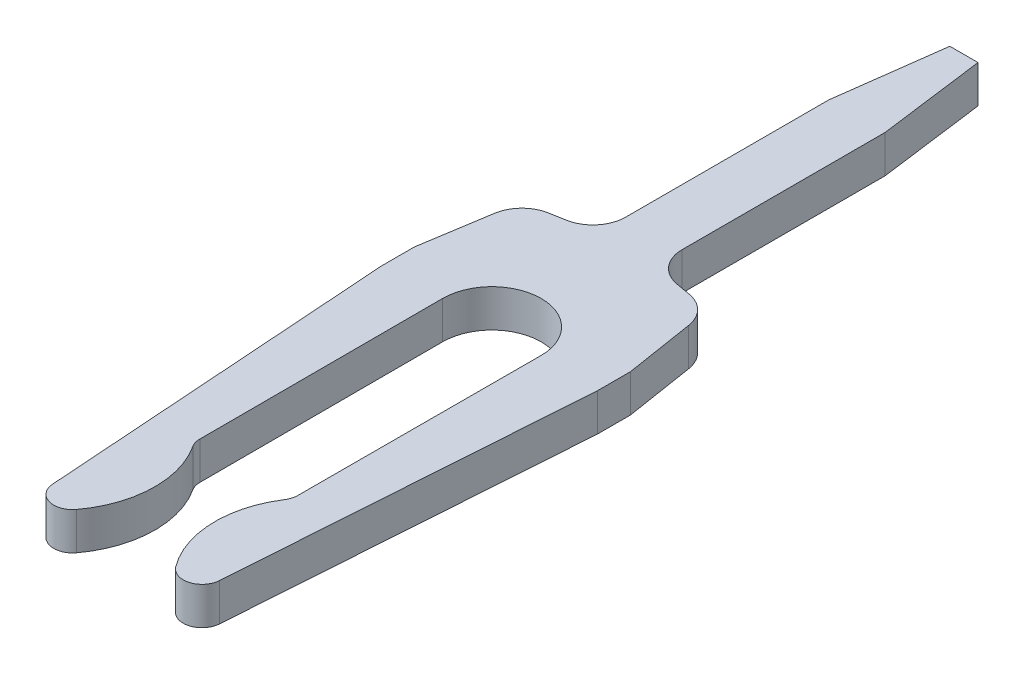
ISO-10303-21;
HEADER;
FILE_DESCRIPTION(('STEP AP214'),'2;1');
FILE_NAME('part.step','',(''),(''),'','','');
FILE_SCHEMA(('AUTOMOTIVE_DESIGN { 1 0 10303 214 1 1 1 1 }'));
ENDSEC;
DATA;
#1=APPLICATION_CONTEXT('core data for automotive mechanical design processes');
#2=APPLICATION_PROTOCOL_DEFINITION('international standard','automotive_design',2000,#1);
#3=PRODUCT_CONTEXT('',#1,'mechanical');
#4=PRODUCT('Part','Part','',(#3));
#5=PRODUCT_RELATED_PRODUCT_CATEGORY('part','',(#4));
#6=PRODUCT_DEFINITION_FORMATION('','',#4);
#7=PRODUCT_DEFINITION_CONTEXT('part definition',#1,'design');
#8=PRODUCT_DEFINITION('design','',#6,#7);
#9=PRODUCT_DEFINITION_SHAPE('','',#8);
#10=(LENGTH_UNIT() NAMED_UNIT(*) SI_UNIT(.MILLI.,.METRE.));
#11=(NAMED_UNIT(*) PLANE_ANGLE_UNIT() SI_UNIT($,.RADIAN.));
#12=(NAMED_UNIT(*) SI_UNIT($,.STERADIAN.) SOLID_ANGLE_UNIT());
#13=UNCERTAINTY_MEASURE_WITH_UNIT(LENGTH_MEASURE(1.E-05),#10,'distance_accuracy_value','');
#14=(GEOMETRIC_REPRESENTATION_CONTEXT(3) GLOBAL_UNCERTAINTY_ASSIGNED_CONTEXT((#13)) GLOBAL_UNIT_ASSIGNED_CONTEXT((#10,
#11,#12)) REPRESENTATION_CONTEXT('',''));
#15=CARTESIAN_POINT('',(0.,0.,0.));
#16=DIRECTION('',(0.,0.,1.));
#17=DIRECTION('',(1.,0.,0.));
#18=AXIS2_PLACEMENT_3D('',#15,#16,#17);
#19=CARTESIAN_POINT('',(0.,-0.2,0.));
#20=DIRECTION('',(0.,1.,0.));
#21=DIRECTION('',(1.,0.,0.));
#22=AXIS2_PLACEMENT_3D('',#19,#20,#21);
#23=PLANE('',#22);
#24=CARTESIAN_POINT('',(0.689021038746,-0.2,5.8));
#25=DIRECTION('',(0.,1.,0.));
#26=DIRECTION('',(-0.80115171912508,0.,0.59846129611106));
#27=AXIS2_PLACEMENT_3D('',#24,#25,#26);
#28=CIRCLE('',#27,0.2);
#29=CARTESIAN_POINT('',(0.52879069492,-0.2,5.919692259222));
#30=VERTEX_POINT('',#29);
#31=CARTESIAN_POINT('',(0.888540227534,-0.2,5.813859772906));
#32=VERTEX_POINT('',#31);
#33=EDGE_CURVE('E25',#30,#32,#28,.T.);
#34=ORIENTED_EDGE('',*,*,#33,.F.);
#35=CARTESIAN_POINT('',(1.37,-0.2,5.291307898307));
#36=DIRECTION('',(0.,1.,0.));
#37=DIRECTION('',(-0.839240132274354,0.,-0.54376097725023));
#38=AXIS2_PLACEMENT_3D('',#35,#36,#37);
#39=CIRCLE('',#38,1.05);
#40=CARTESIAN_POINT('',(0.488797861112,-0.2,4.720358872194));
#41=VERTEX_POINT('',#40);
#42=EDGE_CURVE('E530',#41,#30,#39,.T.);
#43=ORIENTED_EDGE('',*,*,#42,.F.);
#44=CARTESIAN_POINT('',(0.32094983466,-0.2,4.611606676746));
#45=DIRECTION('',(0.,-1.,0.));
#46=DIRECTION('',(0.999998773861923,0.,0.00156597402594488));
#47=AXIS2_PLACEMENT_3D('',#44,#45,#46);
#48=CIRCLE('',#47,0.2);
#49=CARTESIAN_POINT('',(0.520949589432,-0.2,4.611919871551));
#50=VERTEX_POINT('',#49);
#51=EDGE_CURVE('E397',#50,#41,#48,.T.);
#52=ORIENTED_EDGE('',*,*,#51,.F.);
#53=DIRECTION('',(-0.00156597402468689,0.,0.999998773861925));
#54=VECTOR('',#53,1.);
#55=CARTESIAN_POINT('',(0.524999356276,-0.2,2.025822136364));
#56=LINE('',#55,#54);
#57=CARTESIAN_POINT('',(0.524999356276,-0.2,2.025822136364));
#58=VERTEX_POINT('',#57);
#59=EDGE_CURVE('E409',#58,#50,#56,.T.);
#60=ORIENTED_EDGE('',*,*,#59,.F.);
#61=CARTESIAN_POINT('',(0.,-0.2,2.025));
#62=DIRECTION('',(0.,-1.,0.));
#63=DIRECTION('',(-0.999998773861923,0.,0.00156597402585288));
#64=AXIS2_PLACEMENT_3D('',#61,#62,#63);
#65=CIRCLE('',#64,0.525);
#66=CARTESIAN_POINT('',(-0.524999356278,-0.2,2.025822136364));
#67=VERTEX_POINT('',#66);
#68=EDGE_CURVE('E511',#67,#58,#65,.T.);
#69=ORIENTED_EDGE('',*,*,#68,.F.);
#70=DIRECTION('',(-0.00156597402468489,0.,-0.999998773861925));
#71=VECTOR('',#70,1.);
#72=CARTESIAN_POINT('',(-0.520949589432,-0.2,4.611919871551));
#73=LINE('',#72,#71);
#74=CARTESIAN_POINT('',(-0.520949589432,-0.2,4.611919871551));
#75=VERTEX_POINT('',#74);
#76=EDGE_CURVE('E499',#75,#67,#73,.T.);
#77=ORIENTED_EDGE('',*,*,#76,.F.);
#78=CARTESIAN_POINT('',(-0.32094983466,-0.2,4.611606676746));
#79=DIRECTION('',(0.,-1.,0.));
#80=DIRECTION('',(-0.839240132274354,0.,0.54376097725023));
#81=AXIS2_PLACEMENT_3D('',#78,#79,#80);
#82=CIRCLE('',#81,0.2);
#83=CARTESIAN_POINT('',(-0.488797861115,-0.2,4.720358872196));
#84=VERTEX_POINT('',#83);
#85=EDGE_CURVE('E338',#84,#75,#82,.T.);
#86=ORIENTED_EDGE('',*,*,#85,.F.);
#87=CARTESIAN_POINT('',(-1.37,-0.2,5.291307898307));
#88=DIRECTION('',(0.,1.,0.));
#89=DIRECTION('',(0.80115171912508,0.,0.59846129611106));
#90=AXIS2_PLACEMENT_3D('',#87,#88,#89);
#91=CIRCLE('',#90,1.05);
#92=CARTESIAN_POINT('',(-0.528790694919,-0.2,5.919692259224));
#93=VERTEX_POINT('',#92);
#94=EDGE_CURVE('E470',#93,#84,#91,.T.);
#95=ORIENTED_EDGE('',*,*,#94,.F.);
#96=CARTESIAN_POINT('',(-0.689021038746,-0.2,5.8));
#97=DIRECTION('',(0.,1.,0.));
#98=DIRECTION('',(-0.997595943944703,0.,0.0692988645294993));
#99=AXIS2_PLACEMENT_3D('',#96,#97,#98);
#100=CIRCLE('',#99,0.2);
#101=CARTESIAN_POINT('',(-0.888540227534,-0.2,5.813859772906));
#102=VERTEX_POINT('',#101);
#103=EDGE_CURVE('E478',#102,#93,#100,.T.);
#104=ORIENTED_EDGE('',*,*,#103,.F.);
#105=DIRECTION('',(0.0692988645311215,0.,0.99759594394459));
#106=VECTOR('',#105,1.);
#107=CARTESIAN_POINT('',(-1.15,-0.2,2.05));
#108=LINE('',#107,#106);
#109=CARTESIAN_POINT('',(-1.15,-0.2,2.05));
#110=VERTEX_POINT('',#109);
#111=EDGE_CURVE('E461',#110,#102,#108,.T.);
#112=ORIENTED_EDGE('',*,*,#111,.F.);
#113=DIRECTION('',(0.,0.,1.));
#114=VECTOR('',#113,1.);
#115=CARTESIAN_POINT('',(-1.15,-0.2,1.7));
#116=LINE('',#115,#114);
#117=CARTESIAN_POINT('',(-1.15,-0.2,1.7));
#118=VERTEX_POINT('',#117);
#119=EDGE_CURVE('E286',#118,#110,#116,.T.);
#120=ORIENTED_EDGE('',*,*,#119,.F.);
#121=DIRECTION('',(-0.156434465040027,0.,0.98768834059517));
#122=VECTOR('',#121,1.);
#123=CARTESIAN_POINT('',(-1.033217369735,-0.2,0.962663491274));
#124=LINE('',#123,#122);
#125=CARTESIAN_POINT('',(-1.033217369735,-0.2,0.962663491274));
#126=VERTEX_POINT('',#125);
#127=EDGE_CURVE('E302',#126,#118,#124,.T.);
#128=ORIENTED_EDGE('',*,*,#127,.F.);
#129=CARTESIAN_POINT('',(-0.687526450526,-0.2,1.017415554038));
#130=DIRECTION('',(0.,1.,0.));
#131=DIRECTION('',(-0.173648177667033,0.,-0.98480775301219));
#132=AXIS2_PLACEMENT_3D('',#129,#130,#131);
#133=CIRCLE('',#132,0.35);
#134=CARTESIAN_POINT('',(-0.74830331271,-0.2,0.672732840484));
#135=VERTEX_POINT('',#134);
#136=EDGE_CURVE('E325',#135,#126,#133,.T.);
#137=ORIENTED_EDGE('',*,*,#136,.F.);
#138=DIRECTION('',(-0.98480775301219,0.,0.173648177667033));
#139=VECTOR('',#138,1.);
#140=CARTESIAN_POINT('',(-0.589223137817,-0.2,0.644682713554));
#141=LINE('',#140,#139);
#142=CARTESIAN_POINT('',(-0.589223137817,-0.2,0.644682713554));
#143=VERTEX_POINT('',#142);
#144=EDGE_CURVE('E330',#143,#135,#141,.T.);
#145=ORIENTED_EDGE('',*,*,#144,.F.);
#146=CARTESIAN_POINT('',(-0.65,-0.2,0.3));
#147=DIRECTION('',(0.,-1.,0.));
#148=DIRECTION('',(1.,0.,0.));
#149=AXIS2_PLACEMENT_3D('',#146,#147,#148);
#150=CIRCLE('',#149,0.35);
#151=CARTESIAN_POINT('',(-0.3,-0.2,0.3));
#152=VERTEX_POINT('',#151);
#153=EDGE_CURVE('E418',#152,#143,#150,.T.);
#154=ORIENTED_EDGE('',*,*,#153,.F.);
#155=DIRECTION('',(0.,0.,1.));
#156=VECTOR('',#155,1.);
#157=CARTESIAN_POINT('',(-0.3,-0.2,-1.860636883091));
#158=LINE('',#157,#156);
#159=CARTESIAN_POINT('',(-0.3,-0.2,-1.860636883091));
#160=VERTEX_POINT('',#159);
#161=EDGE_CURVE('E295',#160,#152,#158,.T.);
#162=ORIENTED_EDGE('',*,*,#161,.F.);
#163=DIRECTION('',(-0.130526192219976,0.,0.99144486137382));
#164=VECTOR('',#163,1.);
#165=CARTESIAN_POINT('',(-0.15,-0.2,-3.));
#166=LINE('',#165,#164);
#167=CARTESIAN_POINT('',(-0.15,-0.2,-3.));
#168=VERTEX_POINT('',#167);
#169=EDGE_CURVE('E313',#168,#160,#166,.T.);
#170=ORIENTED_EDGE('',*,*,#169,.F.);
#171=DIRECTION('',(-1.,0.,0.));
#172=VECTOR('',#171,1.);
#173=CARTESIAN_POINT('',(0.15,-0.2,-3.));
#174=LINE('',#173,#172);
#175=CARTESIAN_POINT('',(0.15,-0.2,-3.));
#176=VERTEX_POINT('',#175);
#177=EDGE_CURVE('E382',#176,#168,#174,.T.);
#178=ORIENTED_EDGE('',*,*,#177,.F.);
#179=DIRECTION('',(-0.130526192219976,0.,-0.99144486137382));
#180=VECTOR('',#179,1.);
#181=CARTESIAN_POINT('',(0.3,-0.2,-1.860636883091));
#182=LINE('',#181,#180);
#183=CARTESIAN_POINT('',(0.3,-0.2,-1.860636883091));
#184=VERTEX_POINT('',#183);
#185=EDGE_CURVE('E369',#184,#176,#182,.T.);
#186=ORIENTED_EDGE('',*,*,#185,.F.);
#187=DIRECTION('',(0.,0.,-1.));
#188=VECTOR('',#187,1.);
#189=CARTESIAN_POINT('',(0.3,-0.2,0.3));
#190=LINE('',#189,#188);
#191=CARTESIAN_POINT('',(0.3,-0.2,0.3));
#192=VERTEX_POINT('',#191);
#193=EDGE_CURVE('E355',#192,#184,#190,.T.);
#194=ORIENTED_EDGE('',*,*,#193,.F.);
#195=CARTESIAN_POINT('',(0.65,-0.2,0.3));
#196=DIRECTION('',(0.,-1.,0.));
#197=DIRECTION('',(-0.173648177667033,0.,0.98480775301219));
#198=AXIS2_PLACEMENT_3D('',#195,#196,#197);
#199=CIRCLE('',#198,0.35);
#200=CARTESIAN_POINT('',(0.589223137817,-0.2,0.644682713554));
#201=VERTEX_POINT('',#200);
#202=EDGE_CURVE('E319',#201,#192,#199,.T.);
#203=ORIENTED_EDGE('',*,*,#202,.F.);
#204=DIRECTION('',(-0.98480775301219,0.,-0.173648177667033));
#205=VECTOR('',#204,1.);
#206=CARTESIAN_POINT('',(0.74830331271,-0.2,0.672732840484));
#207=LINE('',#206,#205);
#208=CARTESIAN_POINT('',(0.74830331271,-0.2,0.672732840484));
#209=VERTEX_POINT('',#208);
#210=EDGE_CURVE('E290',#209,#201,#207,.T.);
#211=ORIENTED_EDGE('',*,*,#210,.F.);
#212=CARTESIAN_POINT('',(0.687526450526,-0.2,1.017415554038));
#213=DIRECTION('',(0.,1.,0.));
#214=DIRECTION('',(0.98768834059517,0.,-0.156434465040027));
#215=AXIS2_PLACEMENT_3D('',#212,#213,#214);
#216=CIRCLE('',#215,0.35);
#217=CARTESIAN_POINT('',(1.033217369735,-0.2,0.962663491274));
#218=VERTEX_POINT('',#217);
#219=EDGE_CURVE('E258',#218,#209,#216,.T.);
#220=ORIENTED_EDGE('',*,*,#219,.F.);
#221=DIRECTION('',(-0.156434465040027,0.,-0.98768834059517));
#222=VECTOR('',#221,1.);
#223=CARTESIAN_POINT('',(1.15,-0.2,1.7));
#224=LINE('',#223,#222);
#225=CARTESIAN_POINT('',(1.15,-0.2,1.7));
#226=VERTEX_POINT('',#225);
#227=EDGE_CURVE('E269',#226,#218,#224,.T.);
#228=ORIENTED_EDGE('',*,*,#227,.F.);
#229=DIRECTION('',(0.,0.,-1.));
#230=VECTOR('',#229,1.);
#231=CARTESIAN_POINT('',(1.15,-0.2,2.05));
#232=LINE('',#231,#230);
#233=CARTESIAN_POINT('',(1.15,-0.2,2.05));
#234=VERTEX_POINT('',#233);
#235=EDGE_CURVE('E272',#234,#226,#232,.T.);
#236=ORIENTED_EDGE('',*,*,#235,.F.);
#237=DIRECTION('',(0.0692988645311215,0.,-0.99759594394459));
#238=VECTOR('',#237,1.);
#239=CARTESIAN_POINT('',(0.888540227534,-0.2,5.813859772906));
#240=LINE('',#239,#238);
#241=EDGE_CURVE('E547',#32,#234,#240,.T.);
#242=ORIENTED_EDGE('',*,*,#241,.F.);
#243=EDGE_LOOP('',(#34,#43,#52,#60,#69,#77,#86,#95,#104,#112,#120,#128,#137,#145,#154,#162,#170,
#178,#186,#194,#203,#211,#220,#228,#236,#242));
#244=FACE_BOUND('',#243,.T.);
#245=ADVANCED_FACE('F17',(#244),#23,.F.);
#246=CARTESIAN_POINT('',(0.,0.2,0.));
#247=DIRECTION('',(0.,1.,0.));
#248=DIRECTION('',(1.,0.,0.));
#249=AXIS2_PLACEMENT_3D('',#246,#247,#248);
#250=PLANE('',#249);
#251=DIRECTION('',(0.0692988645311215,0.,-0.99759594394459));
#252=VECTOR('',#251,1.);
#253=CARTESIAN_POINT('',(0.888540227534,0.2,5.813859772906));
#254=LINE('',#253,#252);
#255=CARTESIAN_POINT('',(0.888540227534,0.2,5.813859772906));
#256=VERTEX_POINT('',#255);
#257=CARTESIAN_POINT('',(1.15,0.2,2.05));
#258=VERTEX_POINT('',#257);
#259=EDGE_CURVE('E264',#256,#258,#254,.T.);
#260=ORIENTED_EDGE('',*,*,#259,.T.);
#261=DIRECTION('',(0.,0.,-1.));
#262=VECTOR('',#261,1.);
#263=CARTESIAN_POINT('',(1.15,0.2,2.05));
#264=LINE('',#263,#262);
#265=CARTESIAN_POINT('',(1.15,0.2,1.7));
#266=VERTEX_POINT('',#265);
#267=EDGE_CURVE('E261',#258,#266,#264,.T.);
#268=ORIENTED_EDGE('',*,*,#267,.T.);
#269=DIRECTION('',(-0.156434465040027,0.,-0.98768834059517));
#270=VECTOR('',#269,1.);
#271=CARTESIAN_POINT('',(1.15,0.2,1.7));
#272=LINE('',#271,#270);
#273=CARTESIAN_POINT('',(1.033217369735,0.2,0.962663491274));
#274=VERTEX_POINT('',#273);
#275=EDGE_CURVE('E246',#266,#274,#272,.T.);
#276=ORIENTED_EDGE('',*,*,#275,.T.);
#277=CARTESIAN_POINT('',(0.687526450526,0.2,1.017415554038));
#278=DIRECTION('',(0.,1.,0.));
#279=DIRECTION('',(0.98768834059517,0.,-0.156434465040027));
#280=AXIS2_PLACEMENT_3D('',#277,#278,#279);
#281=CIRCLE('',#280,0.35);
#282=CARTESIAN_POINT('',(0.74830331271,0.2,0.672732840484));
#283=VERTEX_POINT('',#282);
#284=EDGE_CURVE('E287',#274,#283,#281,.T.);
#285=ORIENTED_EDGE('',*,*,#284,.T.);
#286=DIRECTION('',(-0.98480775301219,0.,-0.173648177667033));
#287=VECTOR('',#286,1.);
#288=CARTESIAN_POINT('',(0.74830331271,0.2,0.672732840484));
#289=LINE('',#288,#287);
#290=CARTESIAN_POINT('',(0.589223137817,0.2,0.644682713554));
#291=VERTEX_POINT('',#290);
#292=EDGE_CURVE('E315',#283,#291,#289,.T.);
#293=ORIENTED_EDGE('',*,*,#292,.T.);
#294=CARTESIAN_POINT('',(0.65,0.2,0.3));
#295=DIRECTION('',(0.,-1.,0.));
#296=DIRECTION('',(-0.173648177667033,0.,0.98480775301219));
#297=AXIS2_PLACEMENT_3D('',#294,#295,#296);
#298=CIRCLE('',#297,0.35);
#299=CARTESIAN_POINT('',(0.3,0.2,0.3));
#300=VERTEX_POINT('',#299);
#301=EDGE_CURVE('E351',#291,#300,#298,.T.);
#302=ORIENTED_EDGE('',*,*,#301,.T.);
#303=DIRECTION('',(0.,0.,-1.));
#304=VECTOR('',#303,1.);
#305=CARTESIAN_POINT('',(0.3,0.2,0.3));
#306=LINE('',#305,#304);
#307=CARTESIAN_POINT('',(0.3,0.2,-1.860636883091));
#308=VERTEX_POINT('',#307);
#309=EDGE_CURVE('E363',#300,#308,#306,.T.);
#310=ORIENTED_EDGE('',*,*,#309,.T.);
#311=DIRECTION('',(-0.130526192219976,0.,-0.99144486137382));
#312=VECTOR('',#311,1.);
#313=CARTESIAN_POINT('',(0.3,0.2,-1.860636883091));
#314=LINE('',#313,#312);
#315=CARTESIAN_POINT('',(0.15,0.2,-3.));
#316=VERTEX_POINT('',#315);
#317=EDGE_CURVE('E368',#308,#316,#314,.T.);
#318=ORIENTED_EDGE('',*,*,#317,.T.);
#319=DIRECTION('',(-1.,0.,0.));
#320=VECTOR('',#319,1.);
#321=CARTESIAN_POINT('',(0.15,0.2,-3.));
#322=LINE('',#321,#320);
#323=CARTESIAN_POINT('',(-0.15,0.2,-3.));
#324=VERTEX_POINT('',#323);
#325=EDGE_CURVE('E309',#316,#324,#322,.T.);
#326=ORIENTED_EDGE('',*,*,#325,.T.);
#327=DIRECTION('',(-0.130526192219976,0.,0.99144486137382));
#328=VECTOR('',#327,1.);
#329=CARTESIAN_POINT('',(-0.15,0.2,-3.));
#330=LINE('',#329,#328);
#331=CARTESIAN_POINT('',(-0.3,0.2,-1.860636883091));
#332=VERTEX_POINT('',#331);
#333=EDGE_CURVE('E292',#324,#332,#330,.T.);
#334=ORIENTED_EDGE('',*,*,#333,.T.);
#335=DIRECTION('',(0.,0.,1.));
#336=VECTOR('',#335,1.);
#337=CARTESIAN_POINT('',(-0.3,0.2,-1.860636883091));
#338=LINE('',#337,#336);
#339=CARTESIAN_POINT('',(-0.3,0.2,0.3));
#340=VERTEX_POINT('',#339);
#341=EDGE_CURVE('E414',#332,#340,#338,.T.);
#342=ORIENTED_EDGE('',*,*,#341,.T.);
#343=CARTESIAN_POINT('',(-0.65,0.2,0.3));
#344=DIRECTION('',(0.,-1.,0.));
#345=DIRECTION('',(1.,0.,0.));
#346=AXIS2_PLACEMENT_3D('',#343,#344,#345);
#347=CIRCLE('',#346,0.35);
#348=CARTESIAN_POINT('',(-0.589223137817,0.2,0.644682713554));
#349=VERTEX_POINT('',#348);
#350=EDGE_CURVE('E334',#340,#349,#347,.T.);
#351=ORIENTED_EDGE('',*,*,#350,.T.);
#352=DIRECTION('',(-0.98480775301219,0.,0.173648177667033));
#353=VECTOR('',#352,1.);
#354=CARTESIAN_POINT('',(-0.589223137817,0.2,0.644682713554));
#355=LINE('',#354,#353);
#356=CARTESIAN_POINT('',(-0.74830331271,0.2,0.672732840484));
#357=VERTEX_POINT('',#356);
#358=EDGE_CURVE('E321',#349,#357,#355,.T.);
#359=ORIENTED_EDGE('',*,*,#358,.T.);
#360=CARTESIAN_POINT('',(-0.687526450526,0.2,1.017415554038));
#361=DIRECTION('',(0.,1.,0.));
#362=DIRECTION('',(-0.173648177667033,0.,-0.98480775301219));
#363=AXIS2_PLACEMENT_3D('',#360,#361,#362);
#364=CIRCLE('',#363,0.35);
#365=CARTESIAN_POINT('',(-1.033217369735,0.2,0.962663491274));
#366=VERTEX_POINT('',#365);
#367=EDGE_CURVE('E298',#357,#366,#364,.T.);
#368=ORIENTED_EDGE('',*,*,#367,.T.);
#369=DIRECTION('',(-0.156434465040027,0.,0.98768834059517));
#370=VECTOR('',#369,1.);
#371=CARTESIAN_POINT('',(-1.033217369735,0.2,0.962663491274));
#372=LINE('',#371,#370);
#373=CARTESIAN_POINT('',(-1.15,0.2,1.7));
#374=VERTEX_POINT('',#373);
#375=EDGE_CURVE('E451',#366,#374,#372,.T.);
#376=ORIENTED_EDGE('',*,*,#375,.T.);
#377=DIRECTION('',(0.,0.,1.));
#378=VECTOR('',#377,1.);
#379=CARTESIAN_POINT('',(-1.15,0.2,1.7));
#380=LINE('',#379,#378);
#381=CARTESIAN_POINT('',(-1.15,0.2,2.05));
#382=VERTEX_POINT('',#381);
#383=EDGE_CURVE('E285',#374,#382,#380,.T.);
#384=ORIENTED_EDGE('',*,*,#383,.T.);
#385=DIRECTION('',(0.0692988645311215,0.,0.99759594394459));
#386=VECTOR('',#385,1.);
#387=CARTESIAN_POINT('',(-1.15,0.2,2.05));
#388=LINE('',#387,#386);
#389=CARTESIAN_POINT('',(-0.888540227534,0.2,5.813859772906));
#390=VERTEX_POINT('',#389);
#391=EDGE_CURVE('E474',#382,#390,#388,.T.);
#392=ORIENTED_EDGE('',*,*,#391,.T.);
#393=CARTESIAN_POINT('',(-0.689021038746,0.2,5.8));
#394=DIRECTION('',(0.,1.,0.));
#395=DIRECTION('',(-0.997595943944703,0.,0.0692988645294993));
#396=AXIS2_PLACEMENT_3D('',#393,#394,#395);
#397=CIRCLE('',#396,0.2);
#398=CARTESIAN_POINT('',(-0.528790694919,0.2,5.919692259224));
#399=VERTEX_POINT('',#398);
#400=EDGE_CURVE('E486',#390,#399,#397,.T.);
#401=ORIENTED_EDGE('',*,*,#400,.T.);
#402=CARTESIAN_POINT('',(-1.37,0.2,5.291307898307));
#403=DIRECTION('',(0.,1.,0.));
#404=DIRECTION('',(0.80115171912508,0.,0.59846129611106));
#405=AXIS2_PLACEMENT_3D('',#402,#403,#404);
#406=CIRCLE('',#405,1.05);
#407=CARTESIAN_POINT('',(-0.488797861115,0.2,4.720358872196));
#408=VERTEX_POINT('',#407);
#409=EDGE_CURVE('E343',#399,#408,#406,.T.);
#410=ORIENTED_EDGE('',*,*,#409,.T.);
#411=CARTESIAN_POINT('',(-0.32094983466,0.2,4.611606676746));
#412=DIRECTION('',(0.,-1.,0.));
#413=DIRECTION('',(-0.839240132274354,0.,0.54376097725023));
#414=AXIS2_PLACEMENT_3D('',#411,#412,#413);
#415=CIRCLE('',#414,0.2);
#416=CARTESIAN_POINT('',(-0.520949589432,0.2,4.611919871551));
#417=VERTEX_POINT('',#416);
#418=EDGE_CURVE('E426',#408,#417,#415,.T.);
#419=ORIENTED_EDGE('',*,*,#418,.T.);
#420=DIRECTION('',(-0.00156597402468489,0.,-0.999998773861925));
#421=VECTOR('',#420,1.);
#422=CARTESIAN_POINT('',(-0.520949589432,0.2,4.611919871551));
#423=LINE('',#422,#421);
#424=CARTESIAN_POINT('',(-0.524999356278,0.2,2.025822136364));
#425=VERTEX_POINT('',#424);
#426=EDGE_CURVE('E507',#417,#425,#423,.T.);
#427=ORIENTED_EDGE('',*,*,#426,.T.);
#428=CARTESIAN_POINT('',(0.,0.2,2.025));
#429=DIRECTION('',(0.,-1.,0.));
#430=DIRECTION('',(-0.999998773861923,0.,0.00156597402585288));
#431=AXIS2_PLACEMENT_3D('',#428,#429,#430);
#432=CIRCLE('',#431,0.525);
#433=CARTESIAN_POINT('',(0.524999356276,0.2,2.025822136364));
#434=VERTEX_POINT('',#433);
#435=EDGE_CURVE('E405',#425,#434,#432,.T.);
#436=ORIENTED_EDGE('',*,*,#435,.T.);
#437=DIRECTION('',(-0.00156597402468689,0.,0.999998773861925));
#438=VECTOR('',#437,1.);
#439=CARTESIAN_POINT('',(0.524999356276,0.2,2.025822136364));
#440=LINE('',#439,#438);
#441=CARTESIAN_POINT('',(0.520949589432,0.2,4.611919871551));
#442=VERTEX_POINT('',#441);
#443=EDGE_CURVE('E436',#434,#442,#440,.T.);
#444=ORIENTED_EDGE('',*,*,#443,.T.);
#445=CARTESIAN_POINT('',(0.32094983466,0.2,4.611606676746));
#446=DIRECTION('',(0.,-1.,0.));
#447=DIRECTION('',(0.999998773861923,0.,0.00156597402594488));
#448=AXIS2_PLACEMENT_3D('',#445,#446,#447);
#449=CIRCLE('',#448,0.2);
#450=CARTESIAN_POINT('',(0.488797861112,0.2,4.720358872194));
#451=VERTEX_POINT('',#450);
#452=EDGE_CURVE('E396',#442,#451,#449,.T.);
#453=ORIENTED_EDGE('',*,*,#452,.T.);
#454=CARTESIAN_POINT('',(1.37,0.2,5.291307898307));
#455=DIRECTION('',(0.,1.,0.));
#456=DIRECTION('',(-0.839240132274354,0.,-0.54376097725023));
#457=AXIS2_PLACEMENT_3D('',#454,#455,#456);
#458=CIRCLE('',#457,1.05);
#459=CARTESIAN_POINT('',(0.52879069492,0.2,5.919692259222));
#460=VERTEX_POINT('',#459);
#461=EDGE_CURVE('E538',#451,#460,#458,.T.);
#462=ORIENTED_EDGE('',*,*,#461,.T.);
#463=CARTESIAN_POINT('',(0.689021038746,0.2,5.8));
#464=DIRECTION('',(0.,1.,0.));
#465=DIRECTION('',(-0.80115171912508,0.,0.59846129611106));
#466=AXIS2_PLACEMENT_3D('',#463,#464,#465);
#467=CIRCLE('',#466,0.2);
#468=EDGE_CURVE('E11',#460,#256,#467,.T.);
#469=ORIENTED_EDGE('',*,*,#468,.T.);
#470=EDGE_LOOP('',(#260,#268,#276,#285,#293,#302,#310,#318,#326,#334,#342,#351,#359,#368,#376,
#384,#392,#401,#410,#419,#427,#436,#444,#453,#462,#469));
#471=FACE_BOUND('',#470,.T.);
#472=ADVANCED_FACE('F262',(#471),#250,.T.);
#473=CARTESIAN_POINT('',(0.689021038746,-0.2,5.8));
#474=DIRECTION('',(0.,1.,0.));
#475=DIRECTION('',(-0.80115171912508,0.,0.59846129611106));
#476=AXIS2_PLACEMENT_3D('',#473,#474,#475);
#477=CYLINDRICAL_SURFACE('',#476,0.2);
#478=ORIENTED_EDGE('',*,*,#33,.T.);
#479=DIRECTION('',(0.,1.,0.));
#480=VECTOR('',#479,1.);
#481=CARTESIAN_POINT('',(0.888540227534,-0.2,5.813859772906));
#482=LINE('',#481,#480);
#483=EDGE_CURVE('E278',#32,#256,#482,.T.);
#484=ORIENTED_EDGE('',*,*,#483,.T.);
#485=ORIENTED_EDGE('',*,*,#468,.F.);
#486=DIRECTION('',(0.,1.,0.));
#487=VECTOR('',#486,1.);
#488=CARTESIAN_POINT('',(0.528790694919,-0.2,5.919692259224));
#489=LINE('',#488,#487);
#490=EDGE_CURVE('E534',#30,#460,#489,.T.);
#491=ORIENTED_EDGE('',*,*,#490,.F.);
#492=EDGE_LOOP('',(#478,#484,#485,#491));
#493=FACE_BOUND('',#492,.T.);
#494=ADVANCED_FACE('F543',(#493),#477,.T.);
#495=CARTESIAN_POINT('',(1.37,-0.2,5.291307898307));
#496=DIRECTION('',(0.,1.,0.));
#497=DIRECTION('',(-0.839240132274354,0.,-0.54376097725023));
#498=AXIS2_PLACEMENT_3D('',#495,#496,#497);
#499=CYLINDRICAL_SURFACE('',#498,1.05);
#500=ORIENTED_EDGE('',*,*,#42,.T.);
#501=ORIENTED_EDGE('',*,*,#490,.T.);
#502=ORIENTED_EDGE('',*,*,#461,.F.);
#503=DIRECTION('',(0.,1.,0.));
#504=VECTOR('',#503,1.);
#505=CARTESIAN_POINT('',(0.488797861115,-0.2,4.720358872196));
#506=LINE('',#505,#504);
#507=EDGE_CURVE('E392',#41,#451,#506,.T.);
#508=ORIENTED_EDGE('',*,*,#507,.F.);
#509=EDGE_LOOP('',(#500,#501,#502,#508));
#510=FACE_BOUND('',#509,.T.);
#511=ADVANCED_FACE('F597',(#510),#499,.T.);
#512=CARTESIAN_POINT('',(0.32094983466,-0.2,4.611606676746));
#513=DIRECTION('',(0.,-1.,0.));
#514=DIRECTION('',(0.999998773861923,0.,0.00156597402594988));
#515=AXIS2_PLACEMENT_3D('',#512,#513,#514);
#516=CYLINDRICAL_SURFACE('',#515,0.2);
#517=ORIENTED_EDGE('',*,*,#51,.T.);
#518=ORIENTED_EDGE('',*,*,#507,.T.);
#519=ORIENTED_EDGE('',*,*,#452,.F.);
#520=DIRECTION('',(0.,1.,0.));
#521=VECTOR('',#520,1.);
#522=CARTESIAN_POINT('',(0.520949589432,-0.2,4.611919871551));
#523=LINE('',#522,#521);
#524=EDGE_CURVE('E440',#50,#442,#523,.T.);
#525=ORIENTED_EDGE('',*,*,#524,.F.);
#526=EDGE_LOOP('',(#517,#518,#519,#525));
#527=FACE_BOUND('',#526,.T.);
#528=ADVANCED_FACE('F619',(#527),#516,.F.);
#529=CARTESIAN_POINT('',(0.524999356276,-0.2,2.025822136364));
#530=DIRECTION('',(-0.999998773861925,0.,-0.00156597402468689));
#531=DIRECTION('',(-0.00156597402468689,0.,0.999998773861925));
#532=AXIS2_PLACEMENT_3D('',#529,#530,#531);
#533=PLANE('',#532);
#534=ORIENTED_EDGE('',*,*,#59,.T.);
#535=ORIENTED_EDGE('',*,*,#524,.T.);
#536=ORIENTED_EDGE('',*,*,#443,.F.);
#537=DIRECTION('',(0.,1.,0.));
#538=VECTOR('',#537,1.);
#539=CARTESIAN_POINT('',(0.524999356276,-0.2,2.025822136364));
#540=LINE('',#539,#538);
#541=EDGE_CURVE('E410',#58,#434,#540,.T.);
#542=ORIENTED_EDGE('',*,*,#541,.F.);
#543=EDGE_LOOP('',(#534,#535,#536,#542));
#544=FACE_BOUND('',#543,.T.);
#545=ADVANCED_FACE('F616',(#544),#533,.T.);
#546=CARTESIAN_POINT('',(0.,-0.2,2.025));
#547=DIRECTION('',(0.,-1.,0.));
#548=DIRECTION('',(-0.999998773861923,0.,0.00156597402585288));
#549=AXIS2_PLACEMENT_3D('',#546,#547,#548);
#550=CYLINDRICAL_SURFACE('',#549,0.525);
#551=ORIENTED_EDGE('',*,*,#68,.T.);
#552=ORIENTED_EDGE('',*,*,#541,.T.);
#553=ORIENTED_EDGE('',*,*,#435,.F.);
#554=DIRECTION('',(0.,1.,0.));
#555=VECTOR('',#554,1.);
#556=CARTESIAN_POINT('',(-0.524999356276,-0.2,2.025822136364));
#557=LINE('',#556,#555);
#558=EDGE_CURVE('E503',#67,#425,#557,.T.);
#559=ORIENTED_EDGE('',*,*,#558,.F.);
#560=EDGE_LOOP('',(#551,#552,#553,#559));
#561=FACE_BOUND('',#560,.T.);
#562=ADVANCED_FACE('F618',(#561),#550,.F.);
#563=CARTESIAN_POINT('',(-0.520949589432,-0.2,4.611919871551));
#564=DIRECTION('',(0.999998773861925,0.,-0.00156597402468489));
#565=DIRECTION('',(0.,-1.,0.));
#566=AXIS2_PLACEMENT_3D('',#563,#564,#565);
#567=PLANE('',#566);
#568=ORIENTED_EDGE('',*,*,#76,.T.);
#569=ORIENTED_EDGE('',*,*,#558,.T.);
#570=ORIENTED_EDGE('',*,*,#426,.F.);
#571=DIRECTION('',(0.,1.,0.));
#572=VECTOR('',#571,1.);
#573=CARTESIAN_POINT('',(-0.520949589432,-0.2,4.611919871551));
#574=LINE('',#573,#572);
#575=EDGE_CURVE('E342',#75,#417,#574,.T.);
#576=ORIENTED_EDGE('',*,*,#575,.F.);
#577=EDGE_LOOP('',(#568,#569,#570,#576));
#578=FACE_BOUND('',#577,.T.);
#579=ADVANCED_FACE('F625',(#578),#567,.T.);
#580=CARTESIAN_POINT('',(-0.32094983466,-0.2,4.611606676746));
#581=DIRECTION('',(0.,-1.,0.));
#582=DIRECTION('',(-0.839240132274354,0.,0.54376097725023));
#583=AXIS2_PLACEMENT_3D('',#580,#581,#582);
#584=CYLINDRICAL_SURFACE('',#583,0.2);
#585=ORIENTED_EDGE('',*,*,#85,.T.);
#586=ORIENTED_EDGE('',*,*,#575,.T.);
#587=ORIENTED_EDGE('',*,*,#418,.F.);
#588=DIRECTION('',(0.,1.,0.));
#589=VECTOR('',#588,1.);
#590=CARTESIAN_POINT('',(-0.488797861112,-0.2,4.720358872194));
#591=LINE('',#590,#589);
#592=EDGE_CURVE('E466',#84,#408,#591,.T.);
#593=ORIENTED_EDGE('',*,*,#592,.F.);
#594=EDGE_LOOP('',(#585,#586,#587,#593));
#595=FACE_BOUND('',#594,.T.);
#596=ADVANCED_FACE('F639',(#595),#584,.F.);
#597=CARTESIAN_POINT('',(-1.37,-0.2,5.291307898307));
#598=DIRECTION('',(0.,1.,0.));
#599=DIRECTION('',(0.80115171912508,0.,0.59846129611106));
#600=AXIS2_PLACEMENT_3D('',#597,#598,#599);
#601=CYLINDRICAL_SURFACE('',#600,1.05);
#602=ORIENTED_EDGE('',*,*,#94,.T.);
#603=ORIENTED_EDGE('',*,*,#592,.T.);
#604=ORIENTED_EDGE('',*,*,#409,.F.);
#605=DIRECTION('',(0.,1.,0.));
#606=VECTOR('',#605,1.);
#607=CARTESIAN_POINT('',(-0.52879069492,-0.2,5.919692259222));
#608=LINE('',#607,#606);
#609=EDGE_CURVE('E482',#93,#399,#608,.T.);
#610=ORIENTED_EDGE('',*,*,#609,.F.);
#611=EDGE_LOOP('',(#602,#603,#604,#610));
#612=FACE_BOUND('',#611,.T.);
#613=ADVANCED_FACE('F641',(#612),#601,.T.);
#614=CARTESIAN_POINT('',(-0.689021038746,-0.2,5.8));
#615=DIRECTION('',(0.,1.,0.));
#616=DIRECTION('',(-0.997595943944703,0.,0.0692988645294993));
#617=AXIS2_PLACEMENT_3D('',#614,#615,#616);
#618=CYLINDRICAL_SURFACE('',#617,0.2);
#619=ORIENTED_EDGE('',*,*,#103,.T.);
#620=ORIENTED_EDGE('',*,*,#609,.T.);
#621=ORIENTED_EDGE('',*,*,#400,.F.);
#622=DIRECTION('',(0.,1.,0.));
#623=VECTOR('',#622,1.);
#624=CARTESIAN_POINT('',(-0.888540227534,-0.2,5.813859772906));
#625=LINE('',#624,#623);
#626=EDGE_CURVE('E465',#102,#390,#625,.T.);
#627=ORIENTED_EDGE('',*,*,#626,.F.);
#628=EDGE_LOOP('',(#619,#620,#621,#627));
#629=FACE_BOUND('',#628,.T.);
#630=ADVANCED_FACE('F644',(#629),#618,.T.);
#631=CARTESIAN_POINT('',(-1.15,-0.2,2.05));
#632=DIRECTION('',(-0.99759594394459,0.,0.0692988645311215));
#633=DIRECTION('',(0.,1.,0.));
#634=AXIS2_PLACEMENT_3D('',#631,#632,#633);
#635=PLANE('',#634);
#636=ORIENTED_EDGE('',*,*,#111,.T.);
#637=ORIENTED_EDGE('',*,*,#626,.T.);
#638=ORIENTED_EDGE('',*,*,#391,.F.);
#639=DIRECTION('',(0.,1.,0.));
#640=VECTOR('',#639,1.);
#641=CARTESIAN_POINT('',(-1.15,-0.2,2.05));
#642=LINE('',#641,#640);
#643=EDGE_CURVE('E282',#110,#382,#642,.T.);
#644=ORIENTED_EDGE('',*,*,#643,.F.);
#645=EDGE_LOOP('',(#636,#637,#638,#644));
#646=FACE_BOUND('',#645,.T.);
#647=ADVANCED_FACE('F648',(#646),#635,.T.);
#648=CARTESIAN_POINT('',(-1.15,-0.2,1.7));
#649=DIRECTION('',(-1.,0.,0.));
#650=DIRECTION('',(0.,0.,1.));
#651=AXIS2_PLACEMENT_3D('',#648,#649,#650);
#652=PLANE('',#651);
#653=ORIENTED_EDGE('',*,*,#119,.T.);
#654=ORIENTED_EDGE('',*,*,#643,.T.);
#655=ORIENTED_EDGE('',*,*,#383,.F.);
#656=DIRECTION('',(0.,1.,0.));
#657=VECTOR('',#656,1.);
#658=CARTESIAN_POINT('',(-1.15,-0.2,1.7));
#659=LINE('',#658,#657);
#660=EDGE_CURVE('E447',#118,#374,#659,.T.);
#661=ORIENTED_EDGE('',*,*,#660,.F.);
#662=EDGE_LOOP('',(#653,#654,#655,#661));
#663=FACE_BOUND('',#662,.T.);
#664=ADVANCED_FACE('F650',(#663),#652,.T.);
#665=CARTESIAN_POINT('',(-1.033217369735,-0.2,0.962663491274));
#666=DIRECTION('',(-0.98768834059517,0.,-0.156434465040027));
#667=DIRECTION('',(-0.156434465040027,0.,0.98768834059517));
#668=AXIS2_PLACEMENT_3D('',#665,#666,#667);
#669=PLANE('',#668);
#670=ORIENTED_EDGE('',*,*,#127,.T.);
#671=ORIENTED_EDGE('',*,*,#660,.T.);
#672=ORIENTED_EDGE('',*,*,#375,.F.);
#673=DIRECTION('',(0.,1.,0.));
#674=VECTOR('',#673,1.);
#675=CARTESIAN_POINT('',(-1.033217369735,-0.2,0.962663491274));
#676=LINE('',#675,#674);
#677=EDGE_CURVE('E303',#126,#366,#676,.T.);
#678=ORIENTED_EDGE('',*,*,#677,.F.);
#679=EDGE_LOOP('',(#670,#671,#672,#678));
#680=FACE_BOUND('',#679,.T.);
#681=ADVANCED_FACE('F601',(#680),#669,.T.);
#682=CARTESIAN_POINT('',(-0.687526450526,-0.2,1.017415554038));
#683=DIRECTION('',(0.,1.,0.));
#684=DIRECTION('',(-0.173648177667033,0.,-0.98480775301219));
#685=AXIS2_PLACEMENT_3D('',#682,#683,#684);
#686=CYLINDRICAL_SURFACE('',#685,0.35);
#687=ORIENTED_EDGE('',*,*,#136,.T.);
#688=ORIENTED_EDGE('',*,*,#677,.T.);
#689=ORIENTED_EDGE('',*,*,#367,.F.);
#690=DIRECTION('',(0.,1.,0.));
#691=VECTOR('',#690,1.);
#692=CARTESIAN_POINT('',(-0.74830331271,-0.2,0.672732840484));
#693=LINE('',#692,#691);
#694=EDGE_CURVE('E326',#135,#357,#693,.T.);
#695=ORIENTED_EDGE('',*,*,#694,.F.);
#696=EDGE_LOOP('',(#687,#688,#689,#695));
#697=FACE_BOUND('',#696,.T.);
#698=ADVANCED_FACE('F607',(#697),#686,.T.);
#699=CARTESIAN_POINT('',(-0.589223137817,-0.2,0.644682713554));
#700=DIRECTION('',(-0.173648177667033,0.,-0.98480775301219));
#701=DIRECTION('',(-0.98480775301219,0.,0.173648177667033));
#702=AXIS2_PLACEMENT_3D('',#699,#700,#701);
#703=PLANE('',#702);
#704=ORIENTED_EDGE('',*,*,#144,.T.);
#705=ORIENTED_EDGE('',*,*,#694,.T.);
#706=ORIENTED_EDGE('',*,*,#358,.F.);
#707=DIRECTION('',(0.,1.,0.));
#708=VECTOR('',#707,1.);
#709=CARTESIAN_POINT('',(-0.589223137817,-0.2,0.644682713554));
#710=LINE('',#709,#708);
#711=EDGE_CURVE('E422',#143,#349,#710,.T.);
#712=ORIENTED_EDGE('',*,*,#711,.F.);
#713=EDGE_LOOP('',(#704,#705,#706,#712));
#714=FACE_BOUND('',#713,.T.);
#715=ADVANCED_FACE('F603',(#714),#703,.T.);
#716=CARTESIAN_POINT('',(-0.65,-0.2,0.3));
#717=DIRECTION('',(0.,-1.,0.));
#718=DIRECTION('',(1.,0.,0.));
#719=AXIS2_PLACEMENT_3D('',#716,#717,#718);
#720=CYLINDRICAL_SURFACE('',#719,0.35);
#721=ORIENTED_EDGE('',*,*,#153,.T.);
#722=ORIENTED_EDGE('',*,*,#711,.T.);
#723=ORIENTED_EDGE('',*,*,#350,.F.);
#724=DIRECTION('',(0.,1.,0.));
#725=VECTOR('',#724,1.);
#726=CARTESIAN_POINT('',(-0.3,-0.2,0.3));
#727=LINE('',#726,#725);
#728=EDGE_CURVE('E404',#152,#340,#727,.T.);
#729=ORIENTED_EDGE('',*,*,#728,.F.);
#730=EDGE_LOOP('',(#721,#722,#723,#729));
#731=FACE_BOUND('',#730,.T.);
#732=ADVANCED_FACE('F606',(#731),#720,.F.);
#733=CARTESIAN_POINT('',(-0.3,-0.2,-1.860636883091));
#734=DIRECTION('',(-1.,0.,0.));
#735=DIRECTION('',(0.,0.,1.));
#736=AXIS2_PLACEMENT_3D('',#733,#734,#735);
#737=PLANE('',#736);
#738=ORIENTED_EDGE('',*,*,#161,.T.);
#739=ORIENTED_EDGE('',*,*,#728,.T.);
#740=ORIENTED_EDGE('',*,*,#341,.F.);
#741=DIRECTION('',(0.,1.,0.));
#742=VECTOR('',#741,1.);
#743=CARTESIAN_POINT('',(-0.3,-0.2,-1.860636883091));
#744=LINE('',#743,#742);
#745=EDGE_CURVE('E296',#160,#332,#744,.T.);
#746=ORIENTED_EDGE('',*,*,#745,.F.);
#747=EDGE_LOOP('',(#738,#739,#740,#746));
#748=FACE_BOUND('',#747,.T.);
#749=ADVANCED_FACE('F661',(#748),#737,.T.);
#750=CARTESIAN_POINT('',(-0.15,-0.2,-3.));
#751=DIRECTION('',(-0.99144486137382,0.,-0.130526192219976));
#752=DIRECTION('',(-0.130526192219976,0.,0.99144486137382));
#753=AXIS2_PLACEMENT_3D('',#750,#751,#752);
#754=PLANE('',#753);
#755=ORIENTED_EDGE('',*,*,#169,.T.);
#756=ORIENTED_EDGE('',*,*,#745,.T.);
#757=ORIENTED_EDGE('',*,*,#333,.F.);
#758=DIRECTION('',(0.,1.,0.));
#759=VECTOR('',#758,1.);
#760=CARTESIAN_POINT('',(-0.15,-0.2,-3.));
#761=LINE('',#760,#759);
#762=EDGE_CURVE('E314',#168,#324,#761,.T.);
#763=ORIENTED_EDGE('',*,*,#762,.F.);
#764=EDGE_LOOP('',(#755,#756,#757,#763));
#765=FACE_BOUND('',#764,.T.);
#766=ADVANCED_FACE('F663',(#765),#754,.T.);
#767=CARTESIAN_POINT('',(0.15,-0.2,-3.));
#768=DIRECTION('',(0.,0.,-1.));
#769=DIRECTION('',(0.,-1.,0.));
#770=AXIS2_PLACEMENT_3D('',#767,#768,#769);
#771=PLANE('',#770);
#772=ORIENTED_EDGE('',*,*,#177,.T.);
#773=ORIENTED_EDGE('',*,*,#762,.T.);
#774=ORIENTED_EDGE('',*,*,#325,.F.);
#775=DIRECTION('',(0.,1.,0.));
#776=VECTOR('',#775,1.);
#777=CARTESIAN_POINT('',(0.15,-0.2,-3.));
#778=LINE('',#777,#776);
#779=EDGE_CURVE('E364',#176,#316,#778,.T.);
#780=ORIENTED_EDGE('',*,*,#779,.F.);
#781=EDGE_LOOP('',(#772,#773,#774,#780));
#782=FACE_BOUND('',#781,.T.);
#783=ADVANCED_FACE('F666',(#782),#771,.T.);
#784=CARTESIAN_POINT('',(0.3,-0.2,-1.860636883091));
#785=DIRECTION('',(0.99144486137382,0.,-0.130526192219976));
#786=DIRECTION('',(0.,-1.,0.));
#787=AXIS2_PLACEMENT_3D('',#784,#785,#786);
#788=PLANE('',#787);
#789=ORIENTED_EDGE('',*,*,#185,.T.);
#790=ORIENTED_EDGE('',*,*,#779,.T.);
#791=ORIENTED_EDGE('',*,*,#317,.F.);
#792=DIRECTION('',(0.,1.,0.));
#793=VECTOR('',#792,1.);
#794=CARTESIAN_POINT('',(0.3,-0.2,-1.860636883091));
#795=LINE('',#794,#793);
#796=EDGE_CURVE('E359',#184,#308,#795,.T.);
#797=ORIENTED_EDGE('',*,*,#796,.F.);
#798=EDGE_LOOP('',(#789,#790,#791,#797));
#799=FACE_BOUND('',#798,.T.);
#800=ADVANCED_FACE('F669',(#799),#788,.T.);
#801=CARTESIAN_POINT('',(0.3,-0.2,0.3));
#802=DIRECTION('',(1.,0.,0.));
#803=DIRECTION('',(0.,1.,0.));
#804=AXIS2_PLACEMENT_3D('',#801,#802,#803);
#805=PLANE('',#804);
#806=ORIENTED_EDGE('',*,*,#193,.T.);
#807=ORIENTED_EDGE('',*,*,#796,.T.);
#808=ORIENTED_EDGE('',*,*,#309,.F.);
#809=DIRECTION('',(0.,1.,0.));
#810=VECTOR('',#809,1.);
#811=CARTESIAN_POINT('',(0.3,-0.2,0.3));
#812=LINE('',#811,#810);
#813=EDGE_CURVE('E347',#192,#300,#812,.T.);
#814=ORIENTED_EDGE('',*,*,#813,.F.);
#815=EDGE_LOOP('',(#806,#807,#808,#814));
#816=FACE_BOUND('',#815,.T.);
#817=ADVANCED_FACE('F671',(#816),#805,.T.);
#818=CARTESIAN_POINT('',(0.65,-0.2,0.3));
#819=DIRECTION('',(0.,-1.,0.));
#820=DIRECTION('',(-0.173648177667033,0.,0.98480775301219));
#821=AXIS2_PLACEMENT_3D('',#818,#819,#820);
#822=CYLINDRICAL_SURFACE('',#821,0.35);
#823=ORIENTED_EDGE('',*,*,#202,.T.);
#824=ORIENTED_EDGE('',*,*,#813,.T.);
#825=ORIENTED_EDGE('',*,*,#301,.F.);
#826=DIRECTION('',(0.,1.,0.));
#827=VECTOR('',#826,1.);
#828=CARTESIAN_POINT('',(0.589223137817,-0.2,0.644682713554));
#829=LINE('',#828,#827);
#830=EDGE_CURVE('E320',#201,#291,#829,.T.);
#831=ORIENTED_EDGE('',*,*,#830,.F.);
#832=EDGE_LOOP('',(#823,#824,#825,#831));
#833=FACE_BOUND('',#832,.T.);
#834=ADVANCED_FACE('F577',(#833),#822,.F.);
#835=CARTESIAN_POINT('',(0.74830331271,-0.2,0.672732840484));
#836=DIRECTION('',(0.173648177667033,0.,-0.98480775301219));
#837=DIRECTION('',(0.,-1.,0.));
#838=AXIS2_PLACEMENT_3D('',#835,#836,#837);
#839=PLANE('',#838);
#840=ORIENTED_EDGE('',*,*,#210,.T.);
#841=ORIENTED_EDGE('',*,*,#830,.T.);
#842=ORIENTED_EDGE('',*,*,#292,.F.);
#843=DIRECTION('',(0.,1.,0.));
#844=VECTOR('',#843,1.);
#845=CARTESIAN_POINT('',(0.74830331271,-0.2,0.672732840484));
#846=LINE('',#845,#844);
#847=EDGE_CURVE('E291',#209,#283,#846,.T.);
#848=ORIENTED_EDGE('',*,*,#847,.F.);
#849=EDGE_LOOP('',(#840,#841,#842,#848));
#850=FACE_BOUND('',#849,.T.);
#851=ADVANCED_FACE('F573',(#850),#839,.T.);
#852=CARTESIAN_POINT('',(0.687526450526,-0.2,1.017415554038));
#853=DIRECTION('',(0.,1.,0.));
#854=DIRECTION('',(0.98768834059517,0.,-0.156434465040027));
#855=AXIS2_PLACEMENT_3D('',#852,#853,#854);
#856=CYLINDRICAL_SURFACE('',#855,0.35);
#857=ORIENTED_EDGE('',*,*,#219,.T.);
#858=ORIENTED_EDGE('',*,*,#847,.T.);
#859=ORIENTED_EDGE('',*,*,#284,.F.);
#860=DIRECTION('',(0.,1.,0.));
#861=VECTOR('',#860,1.);
#862=CARTESIAN_POINT('',(1.033217369735,-0.2,0.962663491274));
#863=LINE('',#862,#861);
#864=EDGE_CURVE('E254',#218,#274,#863,.T.);
#865=ORIENTED_EDGE('',*,*,#864,.F.);
#866=EDGE_LOOP('',(#857,#858,#859,#865));
#867=FACE_BOUND('',#866,.T.);
#868=ADVANCED_FACE('F579',(#867),#856,.T.);
#869=CARTESIAN_POINT('',(1.15,-0.2,1.7));
#870=DIRECTION('',(0.98768834059517,0.,-0.156434465040027));
#871=DIRECTION('',(0.,-1.,0.));
#872=AXIS2_PLACEMENT_3D('',#869,#870,#871);
#873=PLANE('',#872);
#874=ORIENTED_EDGE('',*,*,#227,.T.);
#875=ORIENTED_EDGE('',*,*,#864,.T.);
#876=ORIENTED_EDGE('',*,*,#275,.F.);
#877=DIRECTION('',(0.,1.,0.));
#878=VECTOR('',#877,1.);
#879=CARTESIAN_POINT('',(1.15,-0.2,1.7));
#880=LINE('',#879,#878);
#881=EDGE_CURVE('E251',#226,#266,#880,.T.);
#882=ORIENTED_EDGE('',*,*,#881,.F.);
#883=EDGE_LOOP('',(#874,#875,#876,#882));
#884=FACE_BOUND('',#883,.T.);
#885=ADVANCED_FACE('F249',(#884),#873,.T.);
#886=CARTESIAN_POINT('',(1.15,-0.2,2.05));
#887=DIRECTION('',(1.,0.,0.));
#888=DIRECTION('',(0.,1.,0.));
#889=AXIS2_PLACEMENT_3D('',#886,#887,#888);
#890=PLANE('',#889);
#891=ORIENTED_EDGE('',*,*,#235,.T.);
#892=ORIENTED_EDGE('',*,*,#881,.T.);
#893=ORIENTED_EDGE('',*,*,#267,.F.);
#894=DIRECTION('',(0.,1.,0.));
#895=VECTOR('',#894,1.);
#896=CARTESIAN_POINT('',(1.15,-0.2,2.05));
#897=LINE('',#896,#895);
#898=EDGE_CURVE('E551',#234,#258,#897,.T.);
#899=ORIENTED_EDGE('',*,*,#898,.F.);
#900=EDGE_LOOP('',(#891,#892,#893,#899));
#901=FACE_BOUND('',#900,.T.);
#902=ADVANCED_FACE('F271',(#901),#890,.T.);
#903=CARTESIAN_POINT('',(0.888540227534,-0.2,5.813859772906));
#904=DIRECTION('',(0.99759594394459,0.,0.0692988645311215));
#905=DIRECTION('',(0.,-1.,0.));
#906=AXIS2_PLACEMENT_3D('',#903,#904,#905);
#907=PLANE('',#906);
#908=ORIENTED_EDGE('',*,*,#241,.T.);
#909=ORIENTED_EDGE('',*,*,#898,.T.);
#910=ORIENTED_EDGE('',*,*,#259,.F.);
#911=ORIENTED_EDGE('',*,*,#483,.F.);
#912=EDGE_LOOP('',(#908,#909,#910,#911));
#913=FACE_BOUND('',#912,.T.);
#914=ADVANCED_FACE('F546',(#913),#907,.T.);
#915=CLOSED_SHELL('',(#245,#472,#494,#511,#528,#545,#562,#579,#596,#613,#630,#647,#664,#681,
#698,#715,#732,#749,#766,#783,#800,#817,#834,#851,#868,#885,#902,#914));
#916=MANIFOLD_SOLID_BREP('B1',#915);
#917=ADVANCED_BREP_SHAPE_REPRESENTATION('',(#18,#916),#14);
#918=SHAPE_DEFINITION_REPRESENTATION(#9,#917);
ENDSEC;
END-ISO-10303-21;
